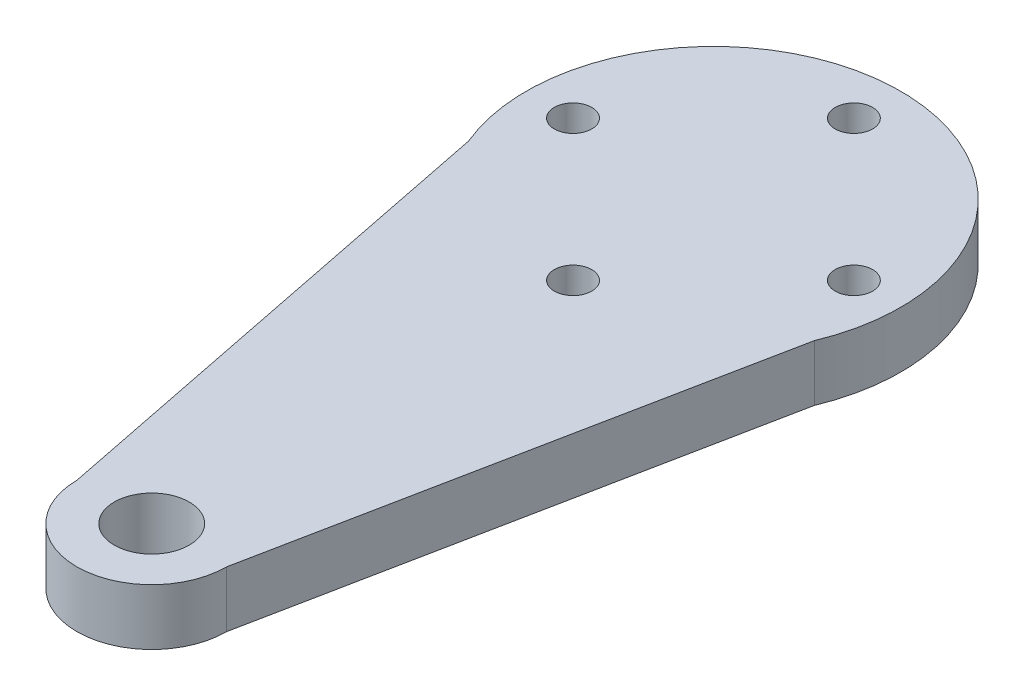
ISO-10303-21;
HEADER;
FILE_DESCRIPTION(('STEP AP214'),'2;1');
FILE_NAME('part.step','',(''),(''),'','','');
FILE_SCHEMA(('AUTOMOTIVE_DESIGN { 1 0 10303 214 1 1 1 1 }'));
ENDSEC;
DATA;
#1=APPLICATION_CONTEXT('core data for automotive mechanical design processes');
#2=APPLICATION_PROTOCOL_DEFINITION('international standard','automotive_design',2000,#1);
#3=PRODUCT_CONTEXT('',#1,'mechanical');
#4=PRODUCT('Part','Part','',(#3));
#5=PRODUCT_RELATED_PRODUCT_CATEGORY('part','',(#4));
#6=PRODUCT_DEFINITION_FORMATION('','',#4);
#7=PRODUCT_DEFINITION_CONTEXT('part definition',#1,'design');
#8=PRODUCT_DEFINITION('design','',#6,#7);
#9=PRODUCT_DEFINITION_SHAPE('','',#8);
#10=(LENGTH_UNIT() NAMED_UNIT(*) SI_UNIT(.MILLI.,.METRE.));
#11=(NAMED_UNIT(*) PLANE_ANGLE_UNIT() SI_UNIT($,.RADIAN.));
#12=(NAMED_UNIT(*) SI_UNIT($,.STERADIAN.) SOLID_ANGLE_UNIT());
#13=UNCERTAINTY_MEASURE_WITH_UNIT(LENGTH_MEASURE(1.E-05),#10,'distance_accuracy_value','');
#14=(GEOMETRIC_REPRESENTATION_CONTEXT(3) GLOBAL_UNCERTAINTY_ASSIGNED_CONTEXT((#13)) GLOBAL_UNIT_ASSIGNED_CONTEXT((#10,
#11,#12)) REPRESENTATION_CONTEXT('',''));
#15=CARTESIAN_POINT('',(0.,0.,0.));
#16=DIRECTION('',(0.,0.,1.));
#17=DIRECTION('',(1.,0.,0.));
#18=AXIS2_PLACEMENT_3D('',#15,#16,#17);
#19=CARTESIAN_POINT('',(0.,3.,30.));
#20=DIRECTION('',(0.,1.,0.));
#21=DIRECTION('',(0.,0.,1.));
#22=AXIS2_PLACEMENT_3D('',#19,#20,#21);
#23=PLANE('',#22);
#24=CARTESIAN_POINT('',(-7.5,3.,0.));
#25=DIRECTION('',(0.,1.,0.));
#26=DIRECTION('',(0.,0.,1.));
#27=AXIS2_PLACEMENT_3D('',#24,#25,#26);
#28=CIRCLE('',#27,1.);
#29=CARTESIAN_POINT('',(-7.5,3.,1.));
#30=VERTEX_POINT('',#29);
#31=EDGE_CURVE('E127',#30,#30,#28,.T.);
#32=ORIENTED_EDGE('',*,*,#31,.F.);
#33=EDGE_LOOP('',(#32));
#34=FACE_BOUND('',#33,.T.);
#35=CARTESIAN_POINT('',(7.5,3.,0.));
#36=DIRECTION('',(0.,1.,0.));
#37=DIRECTION('',(0.,0.,1.));
#38=AXIS2_PLACEMENT_3D('',#35,#36,#37);
#39=CIRCLE('',#38,1.);
#40=CARTESIAN_POINT('',(7.5,3.,1.));
#41=VERTEX_POINT('',#40);
#42=EDGE_CURVE('E115',#41,#41,#39,.T.);
#43=ORIENTED_EDGE('',*,*,#42,.F.);
#44=EDGE_LOOP('',(#43));
#45=FACE_BOUND('',#44,.T.);
#46=CARTESIAN_POINT('',(0.,3.,30.));
#47=DIRECTION('',(0.,1.,0.));
#48=DIRECTION('',(0.,0.,1.));
#49=AXIS2_PLACEMENT_3D('',#46,#47,#48);
#50=CIRCLE('',#49,4.);
#51=CARTESIAN_POINT('',(-4.,3.,30.));
#52=VERTEX_POINT('',#51);
#53=CARTESIAN_POINT('',(4.,3.,30.));
#54=VERTEX_POINT('',#53);
#55=EDGE_CURVE('E85',#52,#54,#50,.T.);
#56=ORIENTED_EDGE('',*,*,#55,.T.);
#57=DIRECTION('',(0.196116135138184,0.,-0.98058067569092));
#58=VECTOR('',#57,1.);
#59=CARTESIAN_POINT('',(4.,3.,30.));
#60=LINE('',#59,#58);
#61=CARTESIAN_POINT('',(9.23076923076923,3.,3.84615384615384));
#62=VERTEX_POINT('',#61);
#63=EDGE_CURVE('E80',#54,#62,#60,.T.);
#64=ORIENTED_EDGE('',*,*,#63,.T.);
#65=CARTESIAN_POINT('',(0.,3.,0.));
#66=DIRECTION('',(0.,1.,0.));
#67=DIRECTION('',(0.,0.,1.));
#68=AXIS2_PLACEMENT_3D('',#65,#66,#67);
#69=CIRCLE('',#68,10.);
#70=CARTESIAN_POINT('',(-9.23076923076923,3.,3.84615384615385));
#71=VERTEX_POINT('',#70);
#72=EDGE_CURVE('E83',#62,#71,#69,.T.);
#73=ORIENTED_EDGE('',*,*,#72,.T.);
#74=DIRECTION('',(0.196116135138184,0.,0.98058067569092));
#75=VECTOR('',#74,1.);
#76=CARTESIAN_POINT('',(-4.,3.,30.));
#77=LINE('',#76,#75);
#78=EDGE_CURVE('E50',#71,#52,#77,.T.);
#79=ORIENTED_EDGE('',*,*,#78,.T.);
#80=EDGE_LOOP('',(#56,#64,#73,#79));
#81=FACE_BOUND('',#80,.T.);
#82=CARTESIAN_POINT('',(0.,3.,-7.5));
#83=DIRECTION('',(0.,1.,0.));
#84=DIRECTION('',(0.,0.,1.));
#85=AXIS2_PLACEMENT_3D('',#82,#83,#84);
#86=CIRCLE('',#85,1.);
#87=CARTESIAN_POINT('',(0.,3.,-6.5));
#88=VERTEX_POINT('',#87);
#89=EDGE_CURVE('E100',#88,#88,#86,.T.);
#90=ORIENTED_EDGE('',*,*,#89,.F.);
#91=EDGE_LOOP('',(#90));
#92=FACE_BOUND('',#91,.T.);
#93=CARTESIAN_POINT('',(0.,3.,7.5));
#94=DIRECTION('',(0.,1.,0.));
#95=DIRECTION('',(0.,0.,1.));
#96=AXIS2_PLACEMENT_3D('',#93,#94,#95);
#97=CIRCLE('',#96,1.);
#98=CARTESIAN_POINT('',(0.,3.,8.5));
#99=VERTEX_POINT('',#98);
#100=EDGE_CURVE('E121',#99,#99,#97,.T.);
#101=ORIENTED_EDGE('',*,*,#100,.F.);
#102=EDGE_LOOP('',(#101));
#103=FACE_BOUND('',#102,.T.);
#104=CARTESIAN_POINT('',(0.,3.,30.));
#105=DIRECTION('',(0.,1.,0.));
#106=DIRECTION('',(0.,0.,1.));
#107=AXIS2_PLACEMENT_3D('',#104,#105,#106);
#108=CIRCLE('',#107,2.);
#109=CARTESIAN_POINT('',(0.,3.,32.));
#110=VERTEX_POINT('',#109);
#111=EDGE_CURVE('E133',#110,#110,#108,.T.);
#112=ORIENTED_EDGE('',*,*,#111,.F.);
#113=EDGE_LOOP('',(#112));
#114=FACE_BOUND('',#113,.T.);
#115=ADVANCED_FACE('F33',(#34,#45,#81,#92,#103,#114),#23,.T.);
#116=CARTESIAN_POINT('',(0.,0.,30.));
#117=DIRECTION('',(0.,1.,0.));
#118=DIRECTION('',(0.,0.,1.));
#119=AXIS2_PLACEMENT_3D('',#116,#117,#118);
#120=PLANE('',#119);
#121=CARTESIAN_POINT('',(-7.5,0.,0.));
#122=DIRECTION('',(0.,1.,0.));
#123=DIRECTION('',(0.,0.,1.));
#124=AXIS2_PLACEMENT_3D('',#121,#122,#123);
#125=CIRCLE('',#124,1.);
#126=CARTESIAN_POINT('',(-7.5,0.,1.));
#127=VERTEX_POINT('',#126);
#128=EDGE_CURVE('E130',#127,#127,#125,.T.);
#129=ORIENTED_EDGE('',*,*,#128,.T.);
#130=EDGE_LOOP('',(#129));
#131=FACE_BOUND('',#130,.T.);
#132=CARTESIAN_POINT('',(7.5,0.,0.));
#133=DIRECTION('',(0.,1.,0.));
#134=DIRECTION('',(0.,0.,1.));
#135=AXIS2_PLACEMENT_3D('',#132,#133,#134);
#136=CIRCLE('',#135,1.);
#137=CARTESIAN_POINT('',(7.5,0.,1.));
#138=VERTEX_POINT('',#137);
#139=EDGE_CURVE('E118',#138,#138,#136,.T.);
#140=ORIENTED_EDGE('',*,*,#139,.T.);
#141=EDGE_LOOP('',(#140));
#142=FACE_BOUND('',#141,.T.);
#143=CARTESIAN_POINT('',(0.,0.,30.));
#144=DIRECTION('',(0.,1.,0.));
#145=DIRECTION('',(0.,0.,1.));
#146=AXIS2_PLACEMENT_3D('',#143,#144,#145);
#147=CIRCLE('',#146,4.);
#148=CARTESIAN_POINT('',(-4.,0.,30.));
#149=VERTEX_POINT('',#148);
#150=CARTESIAN_POINT('',(4.,0.,30.));
#151=VERTEX_POINT('',#150);
#152=EDGE_CURVE('E97',#149,#151,#147,.T.);
#153=ORIENTED_EDGE('',*,*,#152,.F.);
#154=DIRECTION('',(0.196116135138184,0.,0.98058067569092));
#155=VECTOR('',#154,1.);
#156=CARTESIAN_POINT('',(-4.,0.,30.));
#157=LINE('',#156,#155);
#158=CARTESIAN_POINT('',(-9.23076923076923,0.,3.84615384615385));
#159=VERTEX_POINT('',#158);
#160=EDGE_CURVE('E73',#159,#149,#157,.T.);
#161=ORIENTED_EDGE('',*,*,#160,.F.);
#162=CARTESIAN_POINT('',(0.,0.,0.));
#163=DIRECTION('',(0.,1.,0.));
#164=DIRECTION('',(0.,0.,1.));
#165=AXIS2_PLACEMENT_3D('',#162,#163,#164);
#166=CIRCLE('',#165,10.);
#167=CARTESIAN_POINT('',(9.23076923076923,0.,3.84615384615384));
#168=VERTEX_POINT('',#167);
#169=EDGE_CURVE('E67',#168,#159,#166,.T.);
#170=ORIENTED_EDGE('',*,*,#169,.F.);
#171=DIRECTION('',(0.196116135138184,0.,-0.98058067569092));
#172=VECTOR('',#171,1.);
#173=CARTESIAN_POINT('',(4.,0.,30.));
#174=LINE('',#173,#172);
#175=EDGE_CURVE('E89',#151,#168,#174,.T.);
#176=ORIENTED_EDGE('',*,*,#175,.F.);
#177=EDGE_LOOP('',(#153,#161,#170,#176));
#178=FACE_BOUND('',#177,.T.);
#179=CARTESIAN_POINT('',(0.,0.,-7.5));
#180=DIRECTION('',(0.,1.,0.));
#181=DIRECTION('',(0.,0.,1.));
#182=AXIS2_PLACEMENT_3D('',#179,#180,#181);
#183=CIRCLE('',#182,1.);
#184=CARTESIAN_POINT('',(0.,0.,-6.5));
#185=VERTEX_POINT('',#184);
#186=EDGE_CURVE('E112',#185,#185,#183,.T.);
#187=ORIENTED_EDGE('',*,*,#186,.T.);
#188=EDGE_LOOP('',(#187));
#189=FACE_BOUND('',#188,.T.);
#190=CARTESIAN_POINT('',(0.,0.,7.5));
#191=DIRECTION('',(0.,1.,0.));
#192=DIRECTION('',(0.,0.,1.));
#193=AXIS2_PLACEMENT_3D('',#190,#191,#192);
#194=CIRCLE('',#193,1.);
#195=CARTESIAN_POINT('',(0.,0.,8.5));
#196=VERTEX_POINT('',#195);
#197=EDGE_CURVE('E124',#196,#196,#194,.T.);
#198=ORIENTED_EDGE('',*,*,#197,.T.);
#199=EDGE_LOOP('',(#198));
#200=FACE_BOUND('',#199,.T.);
#201=CARTESIAN_POINT('',(0.,0.,30.));
#202=DIRECTION('',(0.,1.,0.));
#203=DIRECTION('',(0.,0.,1.));
#204=AXIS2_PLACEMENT_3D('',#201,#202,#203);
#205=CIRCLE('',#204,2.);
#206=CARTESIAN_POINT('',(0.,0.,32.));
#207=VERTEX_POINT('',#206);
#208=EDGE_CURVE('E136',#207,#207,#205,.T.);
#209=ORIENTED_EDGE('',*,*,#208,.T.);
#210=EDGE_LOOP('',(#209));
#211=FACE_BOUND('',#210,.T.);
#212=ADVANCED_FACE('F108',(#131,#142,#178,#189,#200,#211),#120,.F.);
#213=CARTESIAN_POINT('',(0.,3.,30.));
#214=DIRECTION('',(0.,-1.,0.));
#215=DIRECTION('',(0.,0.,-1.));
#216=AXIS2_PLACEMENT_3D('',#213,#214,#215);
#217=CYLINDRICAL_SURFACE('',#216,4.);
#218=ORIENTED_EDGE('',*,*,#152,.T.);
#219=DIRECTION('',(0.,-1.,0.));
#220=VECTOR('',#219,1.);
#221=CARTESIAN_POINT('',(4.,3.,30.));
#222=LINE('',#221,#220);
#223=EDGE_CURVE('E11',#54,#151,#222,.T.);
#224=ORIENTED_EDGE('',*,*,#223,.F.);
#225=ORIENTED_EDGE('',*,*,#55,.F.);
#226=DIRECTION('',(0.,-1.,0.));
#227=VECTOR('',#226,1.);
#228=CARTESIAN_POINT('',(-4.,3.,30.));
#229=LINE('',#228,#227);
#230=EDGE_CURVE('E93',#52,#149,#229,.T.);
#231=ORIENTED_EDGE('',*,*,#230,.T.);
#232=EDGE_LOOP('',(#218,#224,#225,#231));
#233=FACE_BOUND('',#232,.T.);
#234=ADVANCED_FACE('F35',(#233),#217,.T.);
#235=CARTESIAN_POINT('',(4.,3.,30.));
#236=DIRECTION('',(-0.98058067569092,0.,-0.196116135138184));
#237=DIRECTION('',(-0.196116135138184,0.,0.98058067569092));
#238=AXIS2_PLACEMENT_3D('',#235,#236,#237);
#239=PLANE('',#238);
#240=ORIENTED_EDGE('',*,*,#175,.T.);
#241=DIRECTION('',(0.,-1.,0.));
#242=VECTOR('',#241,1.);
#243=CARTESIAN_POINT('',(9.23076923076923,3.,3.84615384615384));
#244=LINE('',#243,#242);
#245=EDGE_CURVE('E42',#62,#168,#244,.T.);
#246=ORIENTED_EDGE('',*,*,#245,.F.);
#247=ORIENTED_EDGE('',*,*,#63,.F.);
#248=ORIENTED_EDGE('',*,*,#223,.T.);
#249=EDGE_LOOP('',(#240,#246,#247,#248));
#250=FACE_BOUND('',#249,.T.);
#251=ADVANCED_FACE('F88',(#250),#239,.F.);
#252=CARTESIAN_POINT('',(0.,3.,0.));
#253=DIRECTION('',(0.,-1.,0.));
#254=DIRECTION('',(0.,0.,-1.));
#255=AXIS2_PLACEMENT_3D('',#252,#253,#254);
#256=CYLINDRICAL_SURFACE('',#255,10.);
#257=ORIENTED_EDGE('',*,*,#169,.T.);
#258=DIRECTION('',(0.,-1.,0.));
#259=VECTOR('',#258,1.);
#260=CARTESIAN_POINT('',(-9.23076923076923,3.,3.84615384615385));
#261=LINE('',#260,#259);
#262=EDGE_CURVE('E90',#71,#159,#261,.T.);
#263=ORIENTED_EDGE('',*,*,#262,.F.);
#264=ORIENTED_EDGE('',*,*,#72,.F.);
#265=ORIENTED_EDGE('',*,*,#245,.T.);
#266=EDGE_LOOP('',(#257,#263,#264,#265));
#267=FACE_BOUND('',#266,.T.);
#268=ADVANCED_FACE('F91',(#267),#256,.T.);
#269=CARTESIAN_POINT('',(-4.,3.,30.));
#270=DIRECTION('',(0.98058067569092,0.,-0.196116135138184));
#271=DIRECTION('',(-0.196116135138184,0.,-0.98058067569092));
#272=AXIS2_PLACEMENT_3D('',#269,#270,#271);
#273=PLANE('',#272);
#274=ORIENTED_EDGE('',*,*,#160,.T.);
#275=ORIENTED_EDGE('',*,*,#230,.F.);
#276=ORIENTED_EDGE('',*,*,#78,.F.);
#277=ORIENTED_EDGE('',*,*,#262,.T.);
#278=EDGE_LOOP('',(#274,#275,#276,#277));
#279=FACE_BOUND('',#278,.T.);
#280=ADVANCED_FACE('F105',(#279),#273,.F.);
#281=CARTESIAN_POINT('',(0.,3.,-7.5));
#282=DIRECTION('',(0.,-1.,0.));
#283=DIRECTION('',(0.,0.,-1.));
#284=AXIS2_PLACEMENT_3D('',#281,#282,#283);
#285=CYLINDRICAL_SURFACE('',#284,1.);
#286=ORIENTED_EDGE('',*,*,#89,.T.);
#287=EDGE_LOOP('',(#286));
#288=FACE_BOUND('',#287,.T.);
#289=ORIENTED_EDGE('',*,*,#186,.F.);
#290=EDGE_LOOP('',(#289));
#291=FACE_BOUND('',#290,.T.);
#292=ADVANCED_FACE('F156',(#288,#291),#285,.F.);
#293=CARTESIAN_POINT('',(7.5,3.,0.));
#294=DIRECTION('',(0.,-1.,0.));
#295=DIRECTION('',(0.,0.,-1.));
#296=AXIS2_PLACEMENT_3D('',#293,#294,#295);
#297=CYLINDRICAL_SURFACE('',#296,1.);
#298=ORIENTED_EDGE('',*,*,#42,.T.);
#299=EDGE_LOOP('',(#298));
#300=FACE_BOUND('',#299,.T.);
#301=ORIENTED_EDGE('',*,*,#139,.F.);
#302=EDGE_LOOP('',(#301));
#303=FACE_BOUND('',#302,.T.);
#304=ADVANCED_FACE('F202',(#300,#303),#297,.F.);
#305=CARTESIAN_POINT('',(0.,3.,7.5));
#306=DIRECTION('',(0.,-1.,0.));
#307=DIRECTION('',(0.,0.,-1.));
#308=AXIS2_PLACEMENT_3D('',#305,#306,#307);
#309=CYLINDRICAL_SURFACE('',#308,1.);
#310=ORIENTED_EDGE('',*,*,#100,.T.);
#311=EDGE_LOOP('',(#310));
#312=FACE_BOUND('',#311,.T.);
#313=ORIENTED_EDGE('',*,*,#197,.F.);
#314=EDGE_LOOP('',(#313));
#315=FACE_BOUND('',#314,.T.);
#316=ADVANCED_FACE('F210',(#312,#315),#309,.F.);
#317=CARTESIAN_POINT('',(-7.5,3.,0.));
#318=DIRECTION('',(0.,-1.,0.));
#319=DIRECTION('',(0.,0.,-1.));
#320=AXIS2_PLACEMENT_3D('',#317,#318,#319);
#321=CYLINDRICAL_SURFACE('',#320,1.);
#322=ORIENTED_EDGE('',*,*,#31,.T.);
#323=EDGE_LOOP('',(#322));
#324=FACE_BOUND('',#323,.T.);
#325=ORIENTED_EDGE('',*,*,#128,.F.);
#326=EDGE_LOOP('',(#325));
#327=FACE_BOUND('',#326,.T.);
#328=ADVANCED_FACE('F218',(#324,#327),#321,.F.);
#329=CARTESIAN_POINT('',(0.,3.,30.));
#330=DIRECTION('',(0.,-1.,0.));
#331=DIRECTION('',(0.,0.,-1.));
#332=AXIS2_PLACEMENT_3D('',#329,#330,#331);
#333=CYLINDRICAL_SURFACE('',#332,2.);
#334=ORIENTED_EDGE('',*,*,#111,.T.);
#335=EDGE_LOOP('',(#334));
#336=FACE_BOUND('',#335,.T.);
#337=ORIENTED_EDGE('',*,*,#208,.F.);
#338=EDGE_LOOP('',(#337));
#339=FACE_BOUND('',#338,.T.);
#340=ADVANCED_FACE('F142',(#336,#339),#333,.F.);
#341=CLOSED_SHELL('',(#115,#212,#234,#251,#268,#280,#292,#304,#316,#328,#340));
#342=MANIFOLD_SOLID_BREP('B2',#341);
#343=ADVANCED_BREP_SHAPE_REPRESENTATION('',(#18,#342),#14);
#344=SHAPE_DEFINITION_REPRESENTATION(#9,#343);
ENDSEC;
END-ISO-10303-21;
